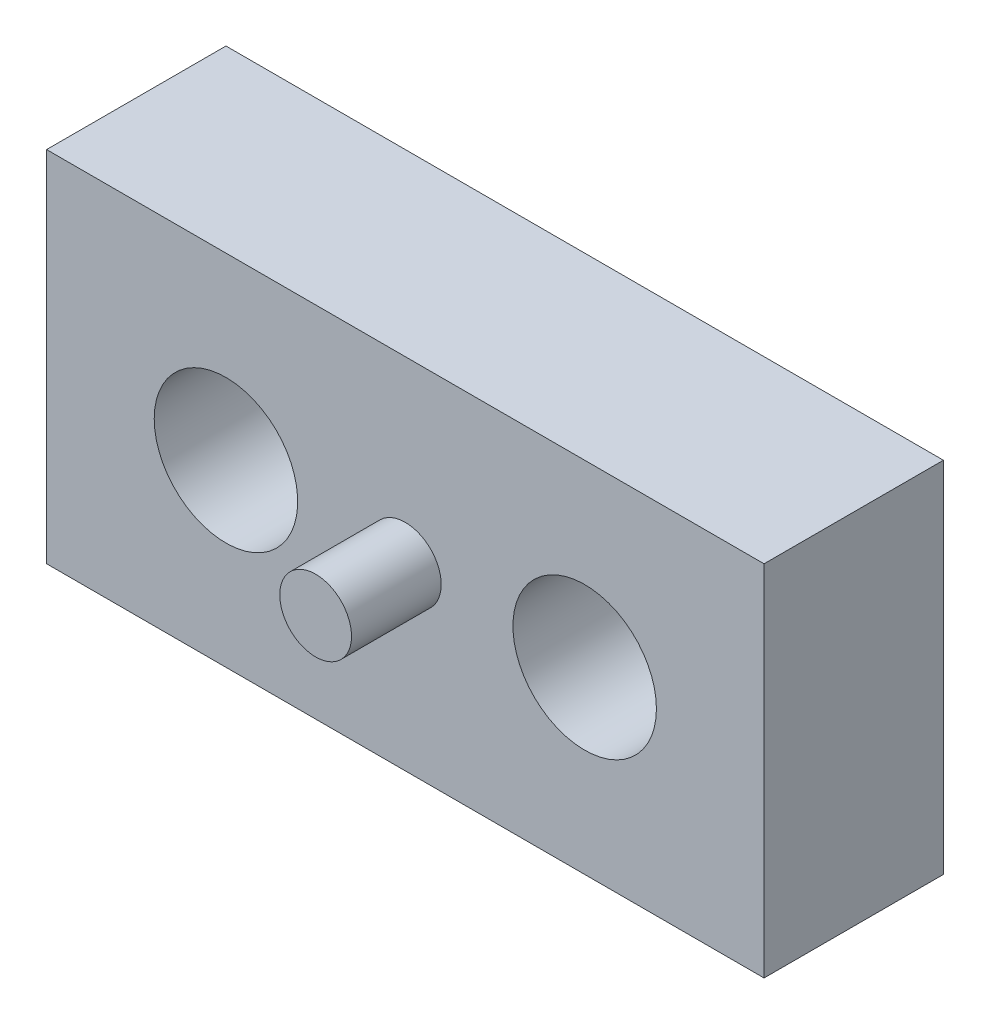
ISO-10303-21;
HEADER;
FILE_DESCRIPTION(('STEP AP214'),'2;1');
FILE_NAME('part.step','',(''),(''),'','','');
FILE_SCHEMA(('AUTOMOTIVE_DESIGN { 1 0 10303 214 1 1 1 1 }'));
ENDSEC;
DATA;
#1=APPLICATION_CONTEXT('core data for automotive mechanical design processes');
#2=APPLICATION_PROTOCOL_DEFINITION('international standard','automotive_design',2000,#1);
#3=PRODUCT_CONTEXT('',#1,'mechanical');
#4=PRODUCT('Part','Part','',(#3));
#5=PRODUCT_RELATED_PRODUCT_CATEGORY('part','',(#4));
#6=PRODUCT_DEFINITION_FORMATION('','',#4);
#7=PRODUCT_DEFINITION_CONTEXT('part definition',#1,'design');
#8=PRODUCT_DEFINITION('design','',#6,#7);
#9=PRODUCT_DEFINITION_SHAPE('','',#8);
#10=(LENGTH_UNIT() NAMED_UNIT(*) SI_UNIT(.MILLI.,.METRE.));
#11=(NAMED_UNIT(*) PLANE_ANGLE_UNIT() SI_UNIT($,.RADIAN.));
#12=(NAMED_UNIT(*) SI_UNIT($,.STERADIAN.) SOLID_ANGLE_UNIT());
#13=UNCERTAINTY_MEASURE_WITH_UNIT(LENGTH_MEASURE(1.E-05),#10,'distance_accuracy_value','');
#14=(GEOMETRIC_REPRESENTATION_CONTEXT(3) GLOBAL_UNCERTAINTY_ASSIGNED_CONTEXT((#13)) GLOBAL_UNIT_ASSIGNED_CONTEXT((#10,
#11,#12)) REPRESENTATION_CONTEXT('',''));
#15=CARTESIAN_POINT('',(0.,0.,0.));
#16=DIRECTION('',(0.,0.,1.));
#17=DIRECTION('',(1.,0.,0.));
#18=AXIS2_PLACEMENT_3D('',#15,#16,#17);
#19=CARTESIAN_POINT('',(4.99999999999999,0.,5.));
#20=DIRECTION('',(0.,0.,-1.));
#21=DIRECTION('',(-1.,0.,0.));
#22=AXIS2_PLACEMENT_3D('',#19,#20,#21);
#23=CYLINDRICAL_SURFACE('',#22,1.);
#24=CARTESIAN_POINT('',(4.99999999999999,0.,0.));
#25=DIRECTION('',(0.,0.,1.));
#26=DIRECTION('',(-1.,0.,0.));
#27=AXIS2_PLACEMENT_3D('',#24,#25,#26);
#28=CIRCLE('',#27,1.);
#29=CARTESIAN_POINT('',(3.99999999999999,0.,0.));
#30=VERTEX_POINT('',#29);
#31=EDGE_CURVE('E156',#30,#30,#28,.T.);
#32=ORIENTED_EDGE('',*,*,#31,.F.);
#33=EDGE_LOOP('',(#32));
#34=FACE_BOUND('',#33,.T.);
#35=CARTESIAN_POINT('',(4.99999999999999,0.,2.));
#36=DIRECTION('',(0.,0.,1.));
#37=DIRECTION('',(1.,0.,0.));
#38=AXIS2_PLACEMENT_3D('',#35,#36,#37);
#39=CIRCLE('',#38,1.);
#40=CARTESIAN_POINT('',(5.99999999999999,0.,2.));
#41=VERTEX_POINT('',#40);
#42=EDGE_CURVE('E125',#41,#41,#39,.T.);
#43=ORIENTED_EDGE('',*,*,#42,.T.);
#44=EDGE_LOOP('',(#43));
#45=FACE_BOUND('',#44,.T.);
#46=ADVANCED_FACE('F39',(#34,#45),#23,.F.);
#47=CARTESIAN_POINT('',(0.,0.,5.));
#48=DIRECTION('',(0.,0.,1.));
#49=DIRECTION('',(1.,0.,0.));
#50=AXIS2_PLACEMENT_3D('',#47,#48,#49);
#51=PLANE('',#50);
#52=CARTESIAN_POINT('',(4.99999999999999,0.,5.));
#53=DIRECTION('',(0.,0.,1.));
#54=DIRECTION('',(1.,0.,0.));
#55=AXIS2_PLACEMENT_3D('',#52,#53,#54);
#56=CIRCLE('',#55,2.);
#57=CARTESIAN_POINT('',(6.99999999999999,0.,5.));
#58=VERTEX_POINT('',#57);
#59=EDGE_CURVE('E136',#58,#58,#56,.T.);
#60=ORIENTED_EDGE('',*,*,#59,.F.);
#61=EDGE_LOOP('',(#60));
#62=FACE_BOUND('',#61,.T.);
#63=CARTESIAN_POINT('',(-4.99999999999999,0.,5.));
#64=DIRECTION('',(0.,0.,1.));
#65=DIRECTION('',(-1.,0.,0.));
#66=AXIS2_PLACEMENT_3D('',#63,#64,#65);
#67=CIRCLE('',#66,2.);
#68=CARTESIAN_POINT('',(-6.99999999999999,0.,5.));
#69=VERTEX_POINT('',#68);
#70=EDGE_CURVE('E148',#69,#69,#67,.T.);
#71=ORIENTED_EDGE('',*,*,#70,.F.);
#72=EDGE_LOOP('',(#71));
#73=FACE_BOUND('',#72,.T.);
#74=CARTESIAN_POINT('',(0.,0.,5.));
#75=DIRECTION('',(0.,0.,1.));
#76=DIRECTION('',(1.,0.,0.));
#77=AXIS2_PLACEMENT_3D('',#74,#75,#76);
#78=CIRCLE('',#77,1.);
#79=CARTESIAN_POINT('',(1.,0.,5.));
#80=VERTEX_POINT('',#79);
#81=EDGE_CURVE('E134',#80,#80,#78,.T.);
#82=ORIENTED_EDGE('',*,*,#81,.F.);
#83=EDGE_LOOP('',(#82));
#84=FACE_BOUND('',#83,.T.);
#85=DIRECTION('',(0.,1.,0.));
#86=VECTOR('',#85,1.);
#87=CARTESIAN_POINT('',(9.99999999999999,5.,5.));
#88=LINE('',#87,#86);
#89=CARTESIAN_POINT('',(9.99999999999999,-5.,5.));
#90=VERTEX_POINT('',#89);
#91=CARTESIAN_POINT('',(9.99999999999999,5.,5.));
#92=VERTEX_POINT('',#91);
#93=EDGE_CURVE('E94',#90,#92,#88,.T.);
#94=ORIENTED_EDGE('',*,*,#93,.T.);
#95=DIRECTION('',(-1.,0.,0.));
#96=VECTOR('',#95,1.);
#97=CARTESIAN_POINT('',(-10.,5.,5.));
#98=LINE('',#97,#96);
#99=CARTESIAN_POINT('',(-10.,5.,5.));
#100=VERTEX_POINT('',#99);
#101=EDGE_CURVE('E89',#92,#100,#98,.T.);
#102=ORIENTED_EDGE('',*,*,#101,.T.);
#103=DIRECTION('',(0.,-1.,0.));
#104=VECTOR('',#103,1.);
#105=CARTESIAN_POINT('',(-10.,5.,5.));
#106=LINE('',#105,#104);
#107=CARTESIAN_POINT('',(-10.,-5.,5.));
#108=VERTEX_POINT('',#107);
#109=EDGE_CURVE('E92',#100,#108,#106,.T.);
#110=ORIENTED_EDGE('',*,*,#109,.T.);
#111=DIRECTION('',(1.,0.,0.));
#112=VECTOR('',#111,1.);
#113=CARTESIAN_POINT('',(-10.,-5.,5.));
#114=LINE('',#113,#112);
#115=EDGE_CURVE('E59',#108,#90,#114,.T.);
#116=ORIENTED_EDGE('',*,*,#115,.T.);
#117=EDGE_LOOP('',(#94,#102,#110,#116));
#118=FACE_BOUND('',#117,.T.);
#119=ADVANCED_FACE('F90',(#62,#73,#84,#118),#51,.T.);
#120=CARTESIAN_POINT('',(0.,0.,0.));
#121=DIRECTION('',(0.,0.,1.));
#122=DIRECTION('',(1.,0.,0.));
#123=AXIS2_PLACEMENT_3D('',#120,#121,#122);
#124=PLANE('',#123);
#125=DIRECTION('',(0.,1.,0.));
#126=VECTOR('',#125,1.);
#127=CARTESIAN_POINT('',(9.99999999999999,5.,0.));
#128=LINE('',#127,#126);
#129=CARTESIAN_POINT('',(9.99999999999999,-5.,0.));
#130=VERTEX_POINT('',#129);
#131=CARTESIAN_POINT('',(9.99999999999999,5.,0.));
#132=VERTEX_POINT('',#131);
#133=EDGE_CURVE('E111',#130,#132,#128,.T.);
#134=ORIENTED_EDGE('',*,*,#133,.F.);
#135=DIRECTION('',(1.,0.,0.));
#136=VECTOR('',#135,1.);
#137=CARTESIAN_POINT('',(-10.,-5.,0.));
#138=LINE('',#137,#136);
#139=CARTESIAN_POINT('',(-10.,-5.,0.));
#140=VERTEX_POINT('',#139);
#141=EDGE_CURVE('E82',#140,#130,#138,.T.);
#142=ORIENTED_EDGE('',*,*,#141,.F.);
#143=DIRECTION('',(0.,-1.,0.));
#144=VECTOR('',#143,1.);
#145=CARTESIAN_POINT('',(-10.,5.,0.));
#146=LINE('',#145,#144);
#147=CARTESIAN_POINT('',(-10.,5.,0.));
#148=VERTEX_POINT('',#147);
#149=EDGE_CURVE('E76',#148,#140,#146,.T.);
#150=ORIENTED_EDGE('',*,*,#149,.F.);
#151=DIRECTION('',(-1.,0.,0.));
#152=VECTOR('',#151,1.);
#153=CARTESIAN_POINT('',(-10.,5.,0.));
#154=LINE('',#153,#152);
#155=EDGE_CURVE('E99',#132,#148,#154,.T.);
#156=ORIENTED_EDGE('',*,*,#155,.F.);
#157=EDGE_LOOP('',(#134,#142,#150,#156));
#158=FACE_BOUND('',#157,.T.);
#159=CARTESIAN_POINT('',(-5.,0.,0.));
#160=DIRECTION('',(0.,0.,1.));
#161=DIRECTION('',(1.,0.,0.));
#162=AXIS2_PLACEMENT_3D('',#159,#160,#161);
#163=CIRCLE('',#162,1.);
#164=CARTESIAN_POINT('',(-4.,0.,0.));
#165=VERTEX_POINT('',#164);
#166=EDGE_CURVE('E115',#165,#165,#163,.T.);
#167=ORIENTED_EDGE('',*,*,#166,.T.);
#168=EDGE_LOOP('',(#167));
#169=FACE_BOUND('',#168,.T.);
#170=ORIENTED_EDGE('',*,*,#31,.T.);
#171=EDGE_LOOP('',(#170));
#172=FACE_BOUND('',#171,.T.);
#173=ADVANCED_FACE('F168',(#158,#169,#172),#124,.F.);
#174=CARTESIAN_POINT('',(9.99999999999999,5.,5.));
#175=DIRECTION('',(-1.,0.,0.));
#176=DIRECTION('',(0.,-1.,0.));
#177=AXIS2_PLACEMENT_3D('',#174,#175,#176);
#178=PLANE('',#177);
#179=ORIENTED_EDGE('',*,*,#133,.T.);
#180=DIRECTION('',(0.,0.,-1.));
#181=VECTOR('',#180,1.);
#182=CARTESIAN_POINT('',(9.99999999999999,5.,5.));
#183=LINE('',#182,#181);
#184=EDGE_CURVE('E11',#92,#132,#183,.T.);
#185=ORIENTED_EDGE('',*,*,#184,.F.);
#186=ORIENTED_EDGE('',*,*,#93,.F.);
#187=DIRECTION('',(0.,0.,-1.));
#188=VECTOR('',#187,1.);
#189=CARTESIAN_POINT('',(9.99999999999999,-5.,5.));
#190=LINE('',#189,#188);
#191=EDGE_CURVE('E107',#90,#130,#190,.T.);
#192=ORIENTED_EDGE('',*,*,#191,.T.);
#193=EDGE_LOOP('',(#179,#185,#186,#192));
#194=FACE_BOUND('',#193,.T.);
#195=ADVANCED_FACE('F41',(#194),#178,.F.);
#196=CARTESIAN_POINT('',(-10.,5.,5.));
#197=DIRECTION('',(0.,-1.,0.));
#198=DIRECTION('',(0.,0.,-1.));
#199=AXIS2_PLACEMENT_3D('',#196,#197,#198);
#200=PLANE('',#199);
#201=ORIENTED_EDGE('',*,*,#155,.T.);
#202=DIRECTION('',(0.,0.,-1.));
#203=VECTOR('',#202,1.);
#204=CARTESIAN_POINT('',(-10.,5.,5.));
#205=LINE('',#204,#203);
#206=EDGE_CURVE('E50',#100,#148,#205,.T.);
#207=ORIENTED_EDGE('',*,*,#206,.F.);
#208=ORIENTED_EDGE('',*,*,#101,.F.);
#209=ORIENTED_EDGE('',*,*,#184,.T.);
#210=EDGE_LOOP('',(#201,#207,#208,#209));
#211=FACE_BOUND('',#210,.T.);
#212=ADVANCED_FACE('F98',(#211),#200,.F.);
#213=CARTESIAN_POINT('',(-10.,5.,5.));
#214=DIRECTION('',(1.,0.,0.));
#215=DIRECTION('',(0.,0.,-1.));
#216=AXIS2_PLACEMENT_3D('',#213,#214,#215);
#217=PLANE('',#216);
#218=ORIENTED_EDGE('',*,*,#149,.T.);
#219=DIRECTION('',(0.,0.,-1.));
#220=VECTOR('',#219,1.);
#221=CARTESIAN_POINT('',(-10.,-5.,5.));
#222=LINE('',#221,#220);
#223=EDGE_CURVE('E101',#108,#140,#222,.T.);
#224=ORIENTED_EDGE('',*,*,#223,.F.);
#225=ORIENTED_EDGE('',*,*,#109,.F.);
#226=ORIENTED_EDGE('',*,*,#206,.T.);
#227=EDGE_LOOP('',(#218,#224,#225,#226));
#228=FACE_BOUND('',#227,.T.);
#229=ADVANCED_FACE('F103',(#228),#217,.F.);
#230=CARTESIAN_POINT('',(-10.,-5.,5.));
#231=DIRECTION('',(0.,1.,0.));
#232=DIRECTION('',(0.,0.,1.));
#233=AXIS2_PLACEMENT_3D('',#230,#231,#232);
#234=PLANE('',#233);
#235=ORIENTED_EDGE('',*,*,#141,.T.);
#236=ORIENTED_EDGE('',*,*,#191,.F.);
#237=ORIENTED_EDGE('',*,*,#115,.F.);
#238=ORIENTED_EDGE('',*,*,#223,.T.);
#239=EDGE_LOOP('',(#235,#236,#237,#238));
#240=FACE_BOUND('',#239,.T.);
#241=ADVANCED_FACE('F174',(#240),#234,.F.);
#242=CARTESIAN_POINT('',(-5.,0.,5.));
#243=DIRECTION('',(0.,0.,-1.));
#244=DIRECTION('',(-1.,0.,0.));
#245=AXIS2_PLACEMENT_3D('',#242,#243,#244);
#246=CYLINDRICAL_SURFACE('',#245,1.);
#247=CARTESIAN_POINT('',(-5.,0.,2.));
#248=DIRECTION('',(0.,0.,-1.));
#249=DIRECTION('',(-1.,0.,0.));
#250=AXIS2_PLACEMENT_3D('',#247,#248,#249);
#251=CIRCLE('',#250,1.);
#252=CARTESIAN_POINT('',(-6.,0.,2.));
#253=VERTEX_POINT('',#252);
#254=EDGE_CURVE('E43',#253,#253,#251,.T.);
#255=ORIENTED_EDGE('',*,*,#254,.F.);
#256=EDGE_LOOP('',(#255));
#257=FACE_BOUND('',#256,.T.);
#258=ORIENTED_EDGE('',*,*,#166,.F.);
#259=EDGE_LOOP('',(#258));
#260=FACE_BOUND('',#259,.T.);
#261=ADVANCED_FACE('F171',(#257,#260),#246,.F.);
#262=CARTESIAN_POINT('',(0.,0.,7.5));
#263=DIRECTION('',(0.,0.,-1.));
#264=DIRECTION('',(-1.,0.,0.));
#265=AXIS2_PLACEMENT_3D('',#262,#263,#264);
#266=CYLINDRICAL_SURFACE('',#265,1.);
#267=CARTESIAN_POINT('',(0.,0.,7.5));
#268=DIRECTION('',(0.,0.,1.));
#269=DIRECTION('',(1.,0.,0.));
#270=AXIS2_PLACEMENT_3D('',#267,#268,#269);
#271=CIRCLE('',#270,1.);
#272=CARTESIAN_POINT('',(1.,0.,7.5));
#273=VERTEX_POINT('',#272);
#274=EDGE_CURVE('E152',#273,#273,#271,.T.);
#275=ORIENTED_EDGE('',*,*,#274,.F.);
#276=EDGE_LOOP('',(#275));
#277=FACE_BOUND('',#276,.T.);
#278=ORIENTED_EDGE('',*,*,#81,.T.);
#279=EDGE_LOOP('',(#278));
#280=FACE_BOUND('',#279,.T.);
#281=ADVANCED_FACE('F173',(#277,#280),#266,.T.);
#282=CARTESIAN_POINT('',(0.,0.,7.5));
#283=DIRECTION('',(0.,0.,1.));
#284=DIRECTION('',(1.,0.,0.));
#285=AXIS2_PLACEMENT_3D('',#282,#283,#284);
#286=PLANE('',#285);
#287=ORIENTED_EDGE('',*,*,#274,.T.);
#288=EDGE_LOOP('',(#287));
#289=FACE_BOUND('',#288,.T.);
#290=ADVANCED_FACE('F182',(#289),#286,.T.);
#291=CARTESIAN_POINT('',(4.99999999999999,0.,2.));
#292=DIRECTION('',(0.,0.,1.));
#293=DIRECTION('',(1.,0.,0.));
#294=AXIS2_PLACEMENT_3D('',#291,#292,#293);
#295=CYLINDRICAL_SURFACE('',#294,2.);
#296=CARTESIAN_POINT('',(4.99999999999999,0.,2.));
#297=DIRECTION('',(0.,0.,1.));
#298=DIRECTION('',(1.,0.,0.));
#299=AXIS2_PLACEMENT_3D('',#296,#297,#298);
#300=CIRCLE('',#299,2.);
#301=CARTESIAN_POINT('',(6.99999999999999,0.,2.));
#302=VERTEX_POINT('',#301);
#303=EDGE_CURVE('E128',#302,#302,#300,.T.);
#304=ORIENTED_EDGE('',*,*,#303,.F.);
#305=EDGE_LOOP('',(#304));
#306=FACE_BOUND('',#305,.T.);
#307=ORIENTED_EDGE('',*,*,#59,.T.);
#308=EDGE_LOOP('',(#307));
#309=FACE_BOUND('',#308,.T.);
#310=ADVANCED_FACE('F200',(#306,#309),#295,.F.);
#311=CARTESIAN_POINT('',(4.99999999999999,0.,2.));
#312=DIRECTION('',(0.,0.,1.));
#313=DIRECTION('',(1.,0.,0.));
#314=AXIS2_PLACEMENT_3D('',#311,#312,#313);
#315=PLANE('',#314);
#316=ORIENTED_EDGE('',*,*,#42,.F.);
#317=EDGE_LOOP('',(#316));
#318=FACE_BOUND('',#317,.T.);
#319=ORIENTED_EDGE('',*,*,#303,.T.);
#320=EDGE_LOOP('',(#319));
#321=FACE_BOUND('',#320,.T.);
#322=ADVANCED_FACE('F206',(#318,#321),#315,.T.);
#323=CARTESIAN_POINT('',(-4.99999999999999,0.,2.));
#324=DIRECTION('',(0.,0.,1.));
#325=DIRECTION('',(1.,0.,0.));
#326=AXIS2_PLACEMENT_3D('',#323,#324,#325);
#327=CYLINDRICAL_SURFACE('',#326,2.);
#328=CARTESIAN_POINT('',(-4.99999999999999,0.,2.));
#329=DIRECTION('',(0.,0.,1.));
#330=DIRECTION('',(-1.,0.,0.));
#331=AXIS2_PLACEMENT_3D('',#328,#329,#330);
#332=CIRCLE('',#331,2.);
#333=CARTESIAN_POINT('',(-6.99999999999999,0.,2.));
#334=VERTEX_POINT('',#333);
#335=EDGE_CURVE('E142',#334,#334,#332,.T.);
#336=ORIENTED_EDGE('',*,*,#335,.F.);
#337=EDGE_LOOP('',(#336));
#338=FACE_BOUND('',#337,.T.);
#339=ORIENTED_EDGE('',*,*,#70,.T.);
#340=EDGE_LOOP('',(#339));
#341=FACE_BOUND('',#340,.T.);
#342=ADVANCED_FACE('F202',(#338,#341),#327,.F.);
#343=CARTESIAN_POINT('',(-4.99999999999999,0.,2.));
#344=DIRECTION('',(0.,0.,-1.));
#345=DIRECTION('',(-1.,0.,0.));
#346=AXIS2_PLACEMENT_3D('',#343,#344,#345);
#347=PLANE('',#346);
#348=ORIENTED_EDGE('',*,*,#254,.T.);
#349=EDGE_LOOP('',(#348));
#350=FACE_BOUND('',#349,.T.);
#351=ORIENTED_EDGE('',*,*,#335,.T.);
#352=EDGE_LOOP('',(#351));
#353=FACE_BOUND('',#352,.T.);
#354=ADVANCED_FACE('F205',(#350,#353),#347,.F.);
#355=CLOSED_SHELL('',(#46,#119,#173,#195,#212,#229,#241,#261,#281,#290,#310,#322,#342,#354));
#356=MANIFOLD_SOLID_BREP('B2',#355);
#357=ADVANCED_BREP_SHAPE_REPRESENTATION('',(#18,#356),#14);
#358=SHAPE_DEFINITION_REPRESENTATION(#9,#357);
ENDSEC;
END-ISO-10303-21;
